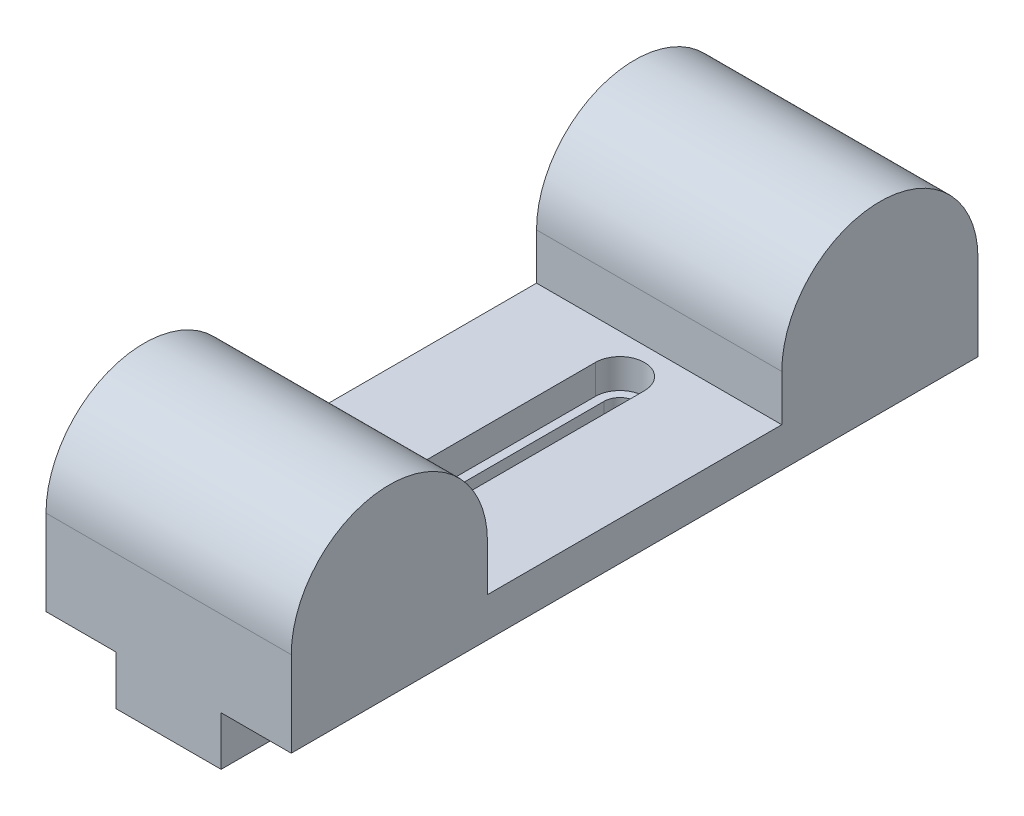
ISO-10303-21;
HEADER;
FILE_DESCRIPTION(('STEP AP214'),'2;1');
FILE_NAME('part.step','',(''),(''),'','','');
FILE_SCHEMA(('AUTOMOTIVE_DESIGN { 1 0 10303 214 1 1 1 1 }'));
ENDSEC;
DATA;
#1=APPLICATION_CONTEXT('core data for automotive mechanical design processes');
#2=APPLICATION_PROTOCOL_DEFINITION('international standard','automotive_design',2000,#1);
#3=PRODUCT_CONTEXT('',#1,'mechanical');
#4=PRODUCT('Part','Part','',(#3));
#5=PRODUCT_RELATED_PRODUCT_CATEGORY('part','',(#4));
#6=PRODUCT_DEFINITION_FORMATION('','',#4);
#7=PRODUCT_DEFINITION_CONTEXT('part definition',#1,'design');
#8=PRODUCT_DEFINITION('design','',#6,#7);
#9=PRODUCT_DEFINITION_SHAPE('','',#8);
#10=(LENGTH_UNIT() NAMED_UNIT(*) SI_UNIT(.MILLI.,.METRE.));
#11=(NAMED_UNIT(*) PLANE_ANGLE_UNIT() SI_UNIT($,.RADIAN.));
#12=(NAMED_UNIT(*) SI_UNIT($,.STERADIAN.) SOLID_ANGLE_UNIT());
#13=UNCERTAINTY_MEASURE_WITH_UNIT(LENGTH_MEASURE(1.E-05),#10,'distance_accuracy_value','');
#14=(GEOMETRIC_REPRESENTATION_CONTEXT(3) GLOBAL_UNCERTAINTY_ASSIGNED_CONTEXT((#13)) GLOBAL_UNIT_ASSIGNED_CONTEXT((#10,
#11,#12)) REPRESENTATION_CONTEXT('',''));
#15=CARTESIAN_POINT('',(0.,0.,0.));
#16=DIRECTION('',(0.,0.,1.));
#17=DIRECTION('',(1.,0.,0.));
#18=AXIS2_PLACEMENT_3D('',#15,#16,#17);
#19=CARTESIAN_POINT('',(0.,-5.,-46.));
#20=DIRECTION('',(0.,1.,0.));
#21=DIRECTION('',(0.,0.,1.));
#22=AXIS2_PLACEMENT_3D('',#19,#20,#21);
#23=CYLINDRICAL_SURFACE('',#22,1.625);
#24=CARTESIAN_POINT('',(0.,1.,-46.));
#25=DIRECTION('',(0.,1.,0.));
#26=DIRECTION('',(0.,0.,1.));
#27=AXIS2_PLACEMENT_3D('',#24,#25,#26);
#28=CIRCLE('',#27,1.625);
#29=CARTESIAN_POINT('',(1.625,1.,-46.));
#30=VERTEX_POINT('',#29);
#31=CARTESIAN_POINT('',(-1.625,1.,-46.));
#32=VERTEX_POINT('',#31);
#33=EDGE_CURVE('E217',#30,#32,#28,.T.);
#34=ORIENTED_EDGE('',*,*,#33,.T.);
#35=DIRECTION('',(0.,1.,0.));
#36=VECTOR('',#35,1.);
#37=CARTESIAN_POINT('',(-1.625,-5.,-46.));
#38=LINE('',#37,#36);
#39=CARTESIAN_POINT('',(-1.62500000000001,-5.,-46.));
#40=VERTEX_POINT('',#39);
#41=EDGE_CURVE('E244',#40,#32,#38,.T.);
#42=ORIENTED_EDGE('',*,*,#41,.F.);
#43=CARTESIAN_POINT('',(0.,-5.,-46.));
#44=DIRECTION('',(0.,1.,0.));
#45=DIRECTION('',(0.,0.,1.));
#46=AXIS2_PLACEMENT_3D('',#43,#44,#45);
#47=CIRCLE('',#46,1.625);
#48=CARTESIAN_POINT('',(-1.4079128759956,-5.,-46.8114224137931));
#49=VERTEX_POINT('',#48);
#50=EDGE_CURVE('E12',#49,#40,#47,.T.);
#51=ORIENTED_EDGE('',*,*,#50,.F.);
#52=DIRECTION('',(0.,1.,0.));
#53=VECTOR('',#52,1.);
#54=CARTESIAN_POINT('',(-1.4079128759956,6.85,-46.8114224137931));
#55=LINE('',#54,#53);
#56=CARTESIAN_POINT('',(-1.4079128759956,0.,-46.8114224137931));
#57=VERTEX_POINT('',#56);
#58=EDGE_CURVE('E259',#57,#49,#55,.F.);
#59=ORIENTED_EDGE('',*,*,#58,.F.);
#60=CARTESIAN_POINT('',(0.,0.,-46.));
#61=DIRECTION('',(0.,1.,0.));
#62=DIRECTION('',(0.,0.,1.));
#63=AXIS2_PLACEMENT_3D('',#60,#61,#62);
#64=CIRCLE('',#63,1.625);
#65=CARTESIAN_POINT('',(1.40791287599559,0.,-46.8114224137931));
#66=VERTEX_POINT('',#65);
#67=EDGE_CURVE('E242',#66,#57,#64,.T.);
#68=ORIENTED_EDGE('',*,*,#67,.F.);
#69=DIRECTION('',(0.,1.,0.));
#70=VECTOR('',#69,1.);
#71=CARTESIAN_POINT('',(1.40791287599558,6.85,-46.8114224137931));
#72=LINE('',#71,#70);
#73=CARTESIAN_POINT('',(1.40791287599558,-5.,-46.8114224137931));
#74=VERTEX_POINT('',#73);
#75=EDGE_CURVE('E237',#74,#66,#72,.T.);
#76=ORIENTED_EDGE('',*,*,#75,.F.);
#77=CARTESIAN_POINT('',(0.,-5.,-46.));
#78=DIRECTION('',(0.,1.,0.));
#79=DIRECTION('',(0.,0.,1.));
#80=AXIS2_PLACEMENT_3D('',#77,#78,#79);
#81=CIRCLE('',#80,1.625);
#82=CARTESIAN_POINT('',(1.625,-5.,-46.));
#83=VERTEX_POINT('',#82);
#84=EDGE_CURVE('E431',#83,#74,#81,.T.);
#85=ORIENTED_EDGE('',*,*,#84,.F.);
#86=DIRECTION('',(0.,1.,0.));
#87=VECTOR('',#86,1.);
#88=CARTESIAN_POINT('',(1.625,-5.,-46.));
#89=LINE('',#88,#87);
#90=EDGE_CURVE('E253',#83,#30,#89,.T.);
#91=ORIENTED_EDGE('',*,*,#90,.T.);
#92=EDGE_LOOP('',(#34,#42,#51,#59,#68,#76,#85,#91));
#93=FACE_BOUND('',#92,.T.);
#94=ADVANCED_FACE('F65',(#93),#23,.F.);
#95=CARTESIAN_POINT('',(1.62500000000001,-5.,0.));
#96=DIRECTION('',(-1.,0.,0.));
#97=DIRECTION('',(0.,0.,1.));
#98=AXIS2_PLACEMENT_3D('',#95,#96,#97);
#99=PLANE('',#98);
#100=DIRECTION('',(0.,1.,0.));
#101=VECTOR('',#100,1.);
#102=CARTESIAN_POINT('',(1.62500000000001,-5.,-25.));
#103=LINE('',#102,#101);
#104=CARTESIAN_POINT('',(1.62500000000001,-5.,-25.));
#105=VERTEX_POINT('',#104);
#106=CARTESIAN_POINT('',(1.62500000000001,1.,-25.));
#107=VERTEX_POINT('',#106);
#108=EDGE_CURVE('E228',#105,#107,#103,.T.);
#109=ORIENTED_EDGE('',*,*,#108,.T.);
#110=DIRECTION('',(0.,0.,-1.));
#111=VECTOR('',#110,1.);
#112=CARTESIAN_POINT('',(1.62500000000001,1.,0.));
#113=LINE('',#112,#111);
#114=EDGE_CURVE('E213',#107,#30,#113,.T.);
#115=ORIENTED_EDGE('',*,*,#114,.T.);
#116=ORIENTED_EDGE('',*,*,#90,.F.);
#117=DIRECTION('',(0.,0.,1.));
#118=VECTOR('',#117,1.);
#119=CARTESIAN_POINT('',(1.62500000000001,-5.,0.));
#120=LINE('',#119,#118);
#121=EDGE_CURVE('E235',#83,#105,#120,.T.);
#122=ORIENTED_EDGE('',*,*,#121,.T.);
#123=EDGE_LOOP('',(#109,#115,#116,#122));
#124=FACE_BOUND('',#123,.T.);
#125=ADVANCED_FACE('F233',(#124),#99,.T.);
#126=CARTESIAN_POINT('',(0.,-5.,-25.));
#127=DIRECTION('',(0.,1.,0.));
#128=DIRECTION('',(0.,0.,1.));
#129=AXIS2_PLACEMENT_3D('',#126,#127,#128);
#130=CYLINDRICAL_SURFACE('',#129,1.62500000000001);
#131=CARTESIAN_POINT('',(0.,1.,-25.));
#132=DIRECTION('',(0.,1.,0.));
#133=DIRECTION('',(0.,0.,1.));
#134=AXIS2_PLACEMENT_3D('',#131,#132,#133);
#135=CIRCLE('',#134,1.62500000000001);
#136=CARTESIAN_POINT('',(-1.625,1.,-25.));
#137=VERTEX_POINT('',#136);
#138=EDGE_CURVE('E89',#137,#107,#135,.T.);
#139=ORIENTED_EDGE('',*,*,#138,.T.);
#140=ORIENTED_EDGE('',*,*,#108,.F.);
#141=CARTESIAN_POINT('',(0.,-5.,-25.));
#142=DIRECTION('',(0.,1.,0.));
#143=DIRECTION('',(0.,0.,1.));
#144=AXIS2_PLACEMENT_3D('',#141,#142,#143);
#145=CIRCLE('',#144,1.62500000000001);
#146=CARTESIAN_POINT('',(-1.625,-5.,-25.));
#147=VERTEX_POINT('',#146);
#148=EDGE_CURVE('E247',#147,#105,#145,.T.);
#149=ORIENTED_EDGE('',*,*,#148,.F.);
#150=DIRECTION('',(0.,1.,0.));
#151=VECTOR('',#150,1.);
#152=CARTESIAN_POINT('',(-1.625,-5.,-25.));
#153=LINE('',#152,#151);
#154=EDGE_CURVE('E230',#147,#137,#153,.T.);
#155=ORIENTED_EDGE('',*,*,#154,.T.);
#156=EDGE_LOOP('',(#139,#140,#149,#155));
#157=FACE_BOUND('',#156,.T.);
#158=ADVANCED_FACE('F226',(#157),#130,.F.);
#159=CARTESIAN_POINT('',(-1.62500000000009,-5.,0.));
#160=DIRECTION('',(-1.,0.,0.));
#161=DIRECTION('',(0.,0.,1.));
#162=AXIS2_PLACEMENT_3D('',#159,#160,#161);
#163=PLANE('',#162);
#164=DIRECTION('',(0.,0.,-1.));
#165=VECTOR('',#164,1.);
#166=CARTESIAN_POINT('',(-1.625,1.,0.));
#167=LINE('',#166,#165);
#168=EDGE_CURVE('E469',#137,#32,#167,.T.);
#169=ORIENTED_EDGE('',*,*,#168,.F.);
#170=ORIENTED_EDGE('',*,*,#154,.F.);
#171=DIRECTION('',(0.,0.,1.));
#172=VECTOR('',#171,1.);
#173=CARTESIAN_POINT('',(-1.62500000000009,-5.,0.));
#174=LINE('',#173,#172);
#175=EDGE_CURVE('E434',#40,#147,#174,.T.);
#176=ORIENTED_EDGE('',*,*,#175,.F.);
#177=ORIENTED_EDGE('',*,*,#41,.T.);
#178=EDGE_LOOP('',(#169,#170,#176,#177));
#179=FACE_BOUND('',#178,.T.);
#180=ADVANCED_FACE('F488',(#179),#163,.F.);
#181=CARTESIAN_POINT('',(12.5,4.,0.));
#182=DIRECTION('',(0.,1.,0.));
#183=DIRECTION('',(0.,0.,1.));
#184=AXIS2_PLACEMENT_3D('',#181,#182,#183);
#185=PLANE('',#184);
#186=CARTESIAN_POINT('',(0.,4.,-25.));
#187=DIRECTION('',(0.,1.,0.));
#188=DIRECTION('',(0.,0.,1.));
#189=AXIS2_PLACEMENT_3D('',#186,#187,#188);
#190=CIRCLE('',#189,2.50000000000001);
#191=CARTESIAN_POINT('',(-2.5,4.,-25.));
#192=VERTEX_POINT('',#191);
#193=CARTESIAN_POINT('',(2.50000000000001,4.,-25.));
#194=VERTEX_POINT('',#193);
#195=EDGE_CURVE('E81',#192,#194,#190,.T.);
#196=ORIENTED_EDGE('',*,*,#195,.F.);
#197=DIRECTION('',(0.,0.,-1.));
#198=VECTOR('',#197,1.);
#199=CARTESIAN_POINT('',(-2.5,4.,0.));
#200=LINE('',#199,#198);
#201=CARTESIAN_POINT('',(-2.50000000000001,4.,-46.));
#202=VERTEX_POINT('',#201);
#203=EDGE_CURVE('E454',#192,#202,#200,.T.);
#204=ORIENTED_EDGE('',*,*,#203,.T.);
#205=CARTESIAN_POINT('',(0.,4.,-46.));
#206=DIRECTION('',(0.,1.,0.));
#207=DIRECTION('',(0.,0.,1.));
#208=AXIS2_PLACEMENT_3D('',#205,#206,#207);
#209=CIRCLE('',#208,2.5);
#210=CARTESIAN_POINT('',(2.49999999999999,4.,-46.));
#211=VERTEX_POINT('',#210);
#212=EDGE_CURVE('E459',#211,#202,#209,.T.);
#213=ORIENTED_EDGE('',*,*,#212,.F.);
#214=DIRECTION('',(0.,0.,-1.));
#215=VECTOR('',#214,1.);
#216=CARTESIAN_POINT('',(2.50000000000001,4.,0.));
#217=LINE('',#216,#215);
#218=EDGE_CURVE('E463',#194,#211,#217,.T.);
#219=ORIENTED_EDGE('',*,*,#218,.F.);
#220=EDGE_LOOP('',(#196,#204,#213,#219));
#221=FACE_BOUND('',#220,.T.);
#222=DIRECTION('',(0.,0.,-1.));
#223=VECTOR('',#222,1.);
#224=CARTESIAN_POINT('',(-12.5,4.,0.));
#225=LINE('',#224,#223);
#226=CARTESIAN_POINT('',(-12.5,4.,-20.));
#227=VERTEX_POINT('',#226);
#228=CARTESIAN_POINT('',(-12.5,4.,-50.));
#229=VERTEX_POINT('',#228);
#230=EDGE_CURVE('E359',#227,#229,#225,.T.);
#231=ORIENTED_EDGE('',*,*,#230,.F.);
#232=DIRECTION('',(-1.,0.,0.));
#233=VECTOR('',#232,1.);
#234=CARTESIAN_POINT('',(12.5,4.,-20.));
#235=LINE('',#234,#233);
#236=CARTESIAN_POINT('',(12.5,4.,-20.));
#237=VERTEX_POINT('',#236);
#238=EDGE_CURVE('E368',#237,#227,#235,.T.);
#239=ORIENTED_EDGE('',*,*,#238,.F.);
#240=DIRECTION('',(0.,0.,-1.));
#241=VECTOR('',#240,1.);
#242=CARTESIAN_POINT('',(12.5,4.,0.));
#243=LINE('',#242,#241);
#244=CARTESIAN_POINT('',(12.5,4.,-50.));
#245=VERTEX_POINT('',#244);
#246=EDGE_CURVE('E328',#237,#245,#243,.T.);
#247=ORIENTED_EDGE('',*,*,#246,.T.);
#248=DIRECTION('',(-1.,0.,0.));
#249=VECTOR('',#248,1.);
#250=CARTESIAN_POINT('',(12.5,4.,-50.));
#251=LINE('',#250,#249);
#252=EDGE_CURVE('E371',#245,#229,#251,.T.);
#253=ORIENTED_EDGE('',*,*,#252,.T.);
#254=EDGE_LOOP('',(#231,#239,#247,#253));
#255=FACE_BOUND('',#254,.T.);
#256=ADVANCED_FACE('F516',(#221,#255),#185,.T.);
#257=CARTESIAN_POINT('',(0.,-5.,-41.65));
#258=DIRECTION('',(0.,1.,0.));
#259=DIRECTION('',(0.,0.,1.));
#260=AXIS2_PLACEMENT_3D('',#257,#258,#259);
#261=CYLINDRICAL_SURFACE('',#260,5.35000000000001);
#262=CARTESIAN_POINT('',(0.,0.,-41.65));
#263=DIRECTION('',(0.,1.,0.));
#264=DIRECTION('',(0.,0.,1.));
#265=AXIS2_PLACEMENT_3D('',#262,#263,#264);
#266=CIRCLE('',#265,5.35000000000001);
#267=CARTESIAN_POINT('',(-5.35000000000002,0.,-41.65));
#268=VERTEX_POINT('',#267);
#269=EDGE_CURVE('E281',#268,#57,#266,.F.);
#270=ORIENTED_EDGE('',*,*,#269,.T.);
#271=ORIENTED_EDGE('',*,*,#58,.T.);
#272=CARTESIAN_POINT('',(0.,-5.,-41.65));
#273=DIRECTION('',(0.,1.,0.));
#274=DIRECTION('',(0.,0.,1.));
#275=AXIS2_PLACEMENT_3D('',#272,#273,#274);
#276=CIRCLE('',#275,5.35000000000001);
#277=CARTESIAN_POINT('',(-5.35000000000002,-5.,-41.65));
#278=VERTEX_POINT('',#277);
#279=EDGE_CURVE('E264',#278,#49,#276,.F.);
#280=ORIENTED_EDGE('',*,*,#279,.F.);
#281=DIRECTION('',(0.,1.,0.));
#282=VECTOR('',#281,1.);
#283=CARTESIAN_POINT('',(-5.35000000000002,-5.,-41.65));
#284=LINE('',#283,#282);
#285=EDGE_CURVE('E280',#278,#268,#284,.T.);
#286=ORIENTED_EDGE('',*,*,#285,.T.);
#287=EDGE_LOOP('',(#270,#271,#280,#286));
#288=FACE_BOUND('',#287,.T.);
#289=ADVANCED_FACE('F491',(#288),#261,.T.);
#290=CARTESIAN_POINT('',(12.5,0.,0.));
#291=DIRECTION('',(0.,1.,0.));
#292=DIRECTION('',(0.,0.,1.));
#293=AXIS2_PLACEMENT_3D('',#290,#291,#292);
#294=PLANE('',#293);
#295=CARTESIAN_POINT('',(5.35,0.,-41.65));
#296=VERTEX_POINT('',#295);
#297=EDGE_CURVE('E263',#66,#296,#266,.F.);
#298=ORIENTED_EDGE('',*,*,#297,.F.);
#299=ORIENTED_EDGE('',*,*,#67,.T.);
#300=ORIENTED_EDGE('',*,*,#269,.F.);
#301=DIRECTION('',(0.,0.,-1.));
#302=VECTOR('',#301,1.);
#303=CARTESIAN_POINT('',(-5.35,0.,0.));
#304=LINE('',#303,#302);
#305=CARTESIAN_POINT('',(-5.35,0.,0.));
#306=VERTEX_POINT('',#305);
#307=EDGE_CURVE('E285',#306,#268,#304,.T.);
#308=ORIENTED_EDGE('',*,*,#307,.F.);
#309=DIRECTION('',(-1.,0.,0.));
#310=VECTOR('',#309,1.);
#311=CARTESIAN_POINT('',(12.5,0.,0.));
#312=LINE('',#311,#310);
#313=CARTESIAN_POINT('',(-12.5,0.,0.));
#314=VERTEX_POINT('',#313);
#315=EDGE_CURVE('E384',#306,#314,#312,.T.);
#316=ORIENTED_EDGE('',*,*,#315,.T.);
#317=DIRECTION('',(0.,0.,-1.));
#318=VECTOR('',#317,1.);
#319=CARTESIAN_POINT('',(-12.5,0.,0.));
#320=LINE('',#319,#318);
#321=CARTESIAN_POINT('',(-12.5,0.,-70.));
#322=VERTEX_POINT('',#321);
#323=EDGE_CURVE('E344',#314,#322,#320,.T.);
#324=ORIENTED_EDGE('',*,*,#323,.T.);
#325=DIRECTION('',(-1.,0.,0.));
#326=VECTOR('',#325,1.);
#327=CARTESIAN_POINT('',(12.5,0.,-70.));
#328=LINE('',#327,#326);
#329=CARTESIAN_POINT('',(12.5,0.,-70.));
#330=VERTEX_POINT('',#329);
#331=EDGE_CURVE('E380',#330,#322,#328,.T.);
#332=ORIENTED_EDGE('',*,*,#331,.F.);
#333=DIRECTION('',(0.,0.,-1.));
#334=VECTOR('',#333,1.);
#335=CARTESIAN_POINT('',(12.5,0.,0.));
#336=LINE('',#335,#334);
#337=CARTESIAN_POINT('',(12.5,0.,0.));
#338=VERTEX_POINT('',#337);
#339=EDGE_CURVE('E315',#338,#330,#336,.T.);
#340=ORIENTED_EDGE('',*,*,#339,.F.);
#341=CARTESIAN_POINT('',(5.35,0.,0.));
#342=VERTEX_POINT('',#341);
#343=EDGE_CURVE('E385',#338,#342,#312,.T.);
#344=ORIENTED_EDGE('',*,*,#343,.T.);
#345=DIRECTION('',(0.,0.,-1.));
#346=VECTOR('',#345,1.);
#347=CARTESIAN_POINT('',(5.35,0.,0.));
#348=LINE('',#347,#346);
#349=EDGE_CURVE('E288',#342,#296,#348,.T.);
#350=ORIENTED_EDGE('',*,*,#349,.T.);
#351=EDGE_LOOP('',(#298,#299,#300,#308,#316,#324,#332,#340,#344,#350));
#352=FACE_BOUND('',#351,.T.);
#353=ADVANCED_FACE('F405',(#352),#294,.F.);
#354=CARTESIAN_POINT('',(12.5,8.7,-10.));
#355=DIRECTION('',(-1.,0.,0.));
#356=DIRECTION('',(0.,0.,1.));
#357=AXIS2_PLACEMENT_3D('',#354,#355,#356);
#358=CYLINDRICAL_SURFACE('',#357,10.);
#359=CARTESIAN_POINT('',(-12.5,8.7,-10.));
#360=DIRECTION('',(1.,0.,0.));
#361=DIRECTION('',(0.,0.,-1.));
#362=AXIS2_PLACEMENT_3D('',#359,#360,#361);
#363=CIRCLE('',#362,10.);
#364=CARTESIAN_POINT('',(-12.5,8.7,0.));
#365=VERTEX_POINT('',#364);
#366=CARTESIAN_POINT('',(-12.5,8.7,-20.));
#367=VERTEX_POINT('',#366);
#368=EDGE_CURVE('E296',#365,#367,#363,.F.);
#369=ORIENTED_EDGE('',*,*,#368,.F.);
#370=DIRECTION('',(-1.,0.,0.));
#371=VECTOR('',#370,1.);
#372=CARTESIAN_POINT('',(12.5,8.7,0.));
#373=LINE('',#372,#371);
#374=CARTESIAN_POINT('',(12.5,8.7,0.));
#375=VERTEX_POINT('',#374);
#376=EDGE_CURVE('E74',#375,#365,#373,.T.);
#377=ORIENTED_EDGE('',*,*,#376,.F.);
#378=CARTESIAN_POINT('',(12.5,8.7,-10.));
#379=DIRECTION('',(1.,0.,0.));
#380=DIRECTION('',(0.,0.,-1.));
#381=AXIS2_PLACEMENT_3D('',#378,#379,#380);
#382=CIRCLE('',#381,10.);
#383=CARTESIAN_POINT('',(12.5,8.7,-20.));
#384=VERTEX_POINT('',#383);
#385=EDGE_CURVE('E306',#375,#384,#382,.F.);
#386=ORIENTED_EDGE('',*,*,#385,.T.);
#387=DIRECTION('',(-1.,0.,0.));
#388=VECTOR('',#387,1.);
#389=CARTESIAN_POINT('',(12.5,8.7,-20.));
#390=LINE('',#389,#388);
#391=EDGE_CURVE('E336',#384,#367,#390,.T.);
#392=ORIENTED_EDGE('',*,*,#391,.T.);
#393=EDGE_LOOP('',(#369,#377,#386,#392));
#394=FACE_BOUND('',#393,.T.);
#395=ADVANCED_FACE('F67',(#394),#358,.T.);
#396=CARTESIAN_POINT('',(12.5,0.,0.));
#397=DIRECTION('',(0.,0.,1.));
#398=DIRECTION('',(1.,0.,0.));
#399=AXIS2_PLACEMENT_3D('',#396,#397,#398);
#400=PLANE('',#399);
#401=DIRECTION('',(0.,1.,0.));
#402=VECTOR('',#401,1.);
#403=CARTESIAN_POINT('',(-12.5,0.,0.));
#404=LINE('',#403,#402);
#405=EDGE_CURVE('E340',#314,#365,#404,.T.);
#406=ORIENTED_EDGE('',*,*,#405,.F.);
#407=ORIENTED_EDGE('',*,*,#315,.F.);
#408=DIRECTION('',(0.,1.,0.));
#409=VECTOR('',#408,1.);
#410=CARTESIAN_POINT('',(-5.35,-5.,0.));
#411=LINE('',#410,#409);
#412=CARTESIAN_POINT('',(-5.35,-5.,0.));
#413=VERTEX_POINT('',#412);
#414=EDGE_CURVE('E300',#413,#306,#411,.T.);
#415=ORIENTED_EDGE('',*,*,#414,.F.);
#416=DIRECTION('',(1.,0.,0.));
#417=VECTOR('',#416,1.);
#418=CARTESIAN_POINT('',(0.,-5.,0.));
#419=LINE('',#418,#417);
#420=CARTESIAN_POINT('',(5.35,-5.,0.));
#421=VERTEX_POINT('',#420);
#422=EDGE_CURVE('E272',#413,#421,#419,.T.);
#423=ORIENTED_EDGE('',*,*,#422,.T.);
#424=DIRECTION('',(0.,1.,0.));
#425=VECTOR('',#424,1.);
#426=CARTESIAN_POINT('',(5.35,-5.,0.));
#427=LINE('',#426,#425);
#428=EDGE_CURVE('E297',#421,#342,#427,.T.);
#429=ORIENTED_EDGE('',*,*,#428,.T.);
#430=ORIENTED_EDGE('',*,*,#343,.F.);
#431=DIRECTION('',(0.,1.,0.));
#432=VECTOR('',#431,1.);
#433=CARTESIAN_POINT('',(12.5,0.,0.));
#434=LINE('',#433,#432);
#435=EDGE_CURVE('E310',#338,#375,#434,.T.);
#436=ORIENTED_EDGE('',*,*,#435,.T.);
#437=ORIENTED_EDGE('',*,*,#376,.T.);
#438=EDGE_LOOP('',(#406,#407,#415,#423,#429,#430,#436,#437));
#439=FACE_BOUND('',#438,.T.);
#440=ADVANCED_FACE('F392',(#439),#400,.T.);
#441=CARTESIAN_POINT('',(12.5,0.,-70.));
#442=DIRECTION('',(0.,0.,1.));
#443=DIRECTION('',(1.,0.,0.));
#444=AXIS2_PLACEMENT_3D('',#441,#442,#443);
#445=PLANE('',#444);
#446=DIRECTION('',(0.,1.,0.));
#447=VECTOR('',#446,1.);
#448=CARTESIAN_POINT('',(-12.5,0.,-70.));
#449=LINE('',#448,#447);
#450=CARTESIAN_POINT('',(-12.5,8.7,-70.));
#451=VERTEX_POINT('',#450);
#452=EDGE_CURVE('E347',#322,#451,#449,.T.);
#453=ORIENTED_EDGE('',*,*,#452,.T.);
#454=DIRECTION('',(-1.,0.,0.));
#455=VECTOR('',#454,1.);
#456=CARTESIAN_POINT('',(12.5,8.7,-70.));
#457=LINE('',#456,#455);
#458=CARTESIAN_POINT('',(12.5,8.7,-70.));
#459=VERTEX_POINT('',#458);
#460=EDGE_CURVE('E377',#459,#451,#457,.T.);
#461=ORIENTED_EDGE('',*,*,#460,.F.);
#462=DIRECTION('',(0.,1.,0.));
#463=VECTOR('',#462,1.);
#464=CARTESIAN_POINT('',(12.5,0.,-70.));
#465=LINE('',#464,#463);
#466=EDGE_CURVE('E318',#330,#459,#465,.T.);
#467=ORIENTED_EDGE('',*,*,#466,.F.);
#468=ORIENTED_EDGE('',*,*,#331,.T.);
#469=EDGE_LOOP('',(#453,#461,#467,#468));
#470=FACE_BOUND('',#469,.T.);
#471=ADVANCED_FACE('F410',(#470),#445,.F.);
#472=CARTESIAN_POINT('',(12.5,8.7,-60.));
#473=DIRECTION('',(-1.,0.,0.));
#474=DIRECTION('',(0.,0.,1.));
#475=AXIS2_PLACEMENT_3D('',#472,#473,#474);
#476=CYLINDRICAL_SURFACE('',#475,10.);
#477=CARTESIAN_POINT('',(-12.5,8.7,-60.));
#478=DIRECTION('',(1.,0.,0.));
#479=DIRECTION('',(0.,0.,-1.));
#480=AXIS2_PLACEMENT_3D('',#477,#478,#479);
#481=CIRCLE('',#480,10.);
#482=CARTESIAN_POINT('',(-12.5,8.7,-50.));
#483=VERTEX_POINT('',#482);
#484=EDGE_CURVE('E351',#483,#451,#481,.F.);
#485=ORIENTED_EDGE('',*,*,#484,.F.);
#486=DIRECTION('',(-1.,0.,0.));
#487=VECTOR('',#486,1.);
#488=CARTESIAN_POINT('',(12.5,8.7,-50.));
#489=LINE('',#488,#487);
#490=CARTESIAN_POINT('',(12.5,8.7,-50.));
#491=VERTEX_POINT('',#490);
#492=EDGE_CURVE('E374',#491,#483,#489,.T.);
#493=ORIENTED_EDGE('',*,*,#492,.F.);
#494=CARTESIAN_POINT('',(12.5,8.7,-60.));
#495=DIRECTION('',(1.,0.,0.));
#496=DIRECTION('',(0.,0.,-1.));
#497=AXIS2_PLACEMENT_3D('',#494,#495,#496);
#498=CIRCLE('',#497,10.);
#499=EDGE_CURVE('E321',#491,#459,#498,.F.);
#500=ORIENTED_EDGE('',*,*,#499,.T.);
#501=ORIENTED_EDGE('',*,*,#460,.T.);
#502=EDGE_LOOP('',(#485,#493,#500,#501));
#503=FACE_BOUND('',#502,.T.);
#504=ADVANCED_FACE('F627',(#503),#476,.T.);
#505=CARTESIAN_POINT('',(12.5,0.,-50.));
#506=DIRECTION('',(0.,0.,-1.));
#507=DIRECTION('',(-1.,0.,0.));
#508=AXIS2_PLACEMENT_3D('',#505,#506,#507);
#509=PLANE('',#508);
#510=DIRECTION('',(0.,-1.,0.));
#511=VECTOR('',#510,1.);
#512=CARTESIAN_POINT('',(-12.5,0.,-50.));
#513=LINE('',#512,#511);
#514=EDGE_CURVE('E355',#483,#229,#513,.T.);
#515=ORIENTED_EDGE('',*,*,#514,.T.);
#516=ORIENTED_EDGE('',*,*,#252,.F.);
#517=DIRECTION('',(0.,-1.,0.));
#518=VECTOR('',#517,1.);
#519=CARTESIAN_POINT('',(12.5,0.,-50.));
#520=LINE('',#519,#518);
#521=EDGE_CURVE('E325',#491,#245,#520,.T.);
#522=ORIENTED_EDGE('',*,*,#521,.F.);
#523=ORIENTED_EDGE('',*,*,#492,.T.);
#524=EDGE_LOOP('',(#515,#516,#522,#523));
#525=FACE_BOUND('',#524,.T.);
#526=ADVANCED_FACE('F634',(#525),#509,.F.);
#527=CARTESIAN_POINT('',(12.5,0.,-20.));
#528=DIRECTION('',(0.,0.,-1.));
#529=DIRECTION('',(0.,1.,0.));
#530=AXIS2_PLACEMENT_3D('',#527,#528,#529);
#531=PLANE('',#530);
#532=DIRECTION('',(0.,-1.,0.));
#533=VECTOR('',#532,1.);
#534=CARTESIAN_POINT('',(-12.5,0.,-20.));
#535=LINE('',#534,#533);
#536=EDGE_CURVE('E311',#367,#227,#535,.T.);
#537=ORIENTED_EDGE('',*,*,#536,.F.);
#538=ORIENTED_EDGE('',*,*,#391,.F.);
#539=DIRECTION('',(0.,-1.,0.));
#540=VECTOR('',#539,1.);
#541=CARTESIAN_POINT('',(12.5,0.,-20.));
#542=LINE('',#541,#540);
#543=EDGE_CURVE('E332',#384,#237,#542,.T.);
#544=ORIENTED_EDGE('',*,*,#543,.T.);
#545=ORIENTED_EDGE('',*,*,#238,.T.);
#546=EDGE_LOOP('',(#537,#538,#544,#545));
#547=FACE_BOUND('',#546,.T.);
#548=ADVANCED_FACE('F642',(#547),#531,.T.);
#549=CARTESIAN_POINT('',(12.5,0.,0.));
#550=DIRECTION('',(1.,0.,0.));
#551=DIRECTION('',(0.,0.,-1.));
#552=AXIS2_PLACEMENT_3D('',#549,#550,#551);
#553=PLANE('',#552);
#554=ORIENTED_EDGE('',*,*,#385,.F.);
#555=ORIENTED_EDGE('',*,*,#435,.F.);
#556=ORIENTED_EDGE('',*,*,#339,.T.);
#557=ORIENTED_EDGE('',*,*,#466,.T.);
#558=ORIENTED_EDGE('',*,*,#499,.F.);
#559=ORIENTED_EDGE('',*,*,#521,.T.);
#560=ORIENTED_EDGE('',*,*,#246,.F.);
#561=ORIENTED_EDGE('',*,*,#543,.F.);
#562=EDGE_LOOP('',(#554,#555,#556,#557,#558,#559,#560,#561));
#563=FACE_BOUND('',#562,.T.);
#564=ADVANCED_FACE('F414',(#563),#553,.T.);
#565=CARTESIAN_POINT('',(-12.5,0.,0.));
#566=DIRECTION('',(1.,0.,0.));
#567=DIRECTION('',(0.,0.,-1.));
#568=AXIS2_PLACEMENT_3D('',#565,#566,#567);
#569=PLANE('',#568);
#570=ORIENTED_EDGE('',*,*,#368,.T.);
#571=ORIENTED_EDGE('',*,*,#536,.T.);
#572=ORIENTED_EDGE('',*,*,#230,.T.);
#573=ORIENTED_EDGE('',*,*,#514,.F.);
#574=ORIENTED_EDGE('',*,*,#484,.T.);
#575=ORIENTED_EDGE('',*,*,#452,.F.);
#576=ORIENTED_EDGE('',*,*,#323,.F.);
#577=ORIENTED_EDGE('',*,*,#405,.T.);
#578=EDGE_LOOP('',(#570,#571,#572,#573,#574,#575,#576,#577));
#579=FACE_BOUND('',#578,.T.);
#580=ADVANCED_FACE('F400',(#579),#569,.F.);
#581=CARTESIAN_POINT('',(5.35,-5.,-41.65));
#582=VERTEX_POINT('',#581);
#583=EDGE_CURVE('E269',#74,#582,#276,.F.);
#584=ORIENTED_EDGE('',*,*,#583,.F.);
#585=ORIENTED_EDGE('',*,*,#75,.T.);
#586=ORIENTED_EDGE('',*,*,#297,.T.);
#587=DIRECTION('',(0.,1.,0.));
#588=VECTOR('',#587,1.);
#589=CARTESIAN_POINT('',(5.35,-5.,-41.65));
#590=LINE('',#589,#588);
#591=EDGE_CURVE('E292',#582,#296,#590,.T.);
#592=ORIENTED_EDGE('',*,*,#591,.F.);
#593=EDGE_LOOP('',(#584,#585,#586,#592));
#594=FACE_BOUND('',#593,.T.);
#595=ADVANCED_FACE('F423',(#594),#261,.T.);
#596=CARTESIAN_POINT('',(5.35,-5.,0.));
#597=DIRECTION('',(1.,0.,0.));
#598=DIRECTION('',(0.,0.,-1.));
#599=AXIS2_PLACEMENT_3D('',#596,#597,#598);
#600=PLANE('',#599);
#601=ORIENTED_EDGE('',*,*,#349,.F.);
#602=ORIENTED_EDGE('',*,*,#428,.F.);
#603=DIRECTION('',(0.,0.,-1.));
#604=VECTOR('',#603,1.);
#605=CARTESIAN_POINT('',(5.35,-5.,0.));
#606=LINE('',#605,#604);
#607=EDGE_CURVE('E276',#421,#582,#606,.T.);
#608=ORIENTED_EDGE('',*,*,#607,.T.);
#609=ORIENTED_EDGE('',*,*,#591,.T.);
#610=EDGE_LOOP('',(#601,#602,#608,#609));
#611=FACE_BOUND('',#610,.T.);
#612=ADVANCED_FACE('F419',(#611),#600,.T.);
#613=CARTESIAN_POINT('',(-5.35,-5.,0.));
#614=DIRECTION('',(1.,0.,0.));
#615=DIRECTION('',(0.,0.,-1.));
#616=AXIS2_PLACEMENT_3D('',#613,#614,#615);
#617=PLANE('',#616);
#618=ORIENTED_EDGE('',*,*,#307,.T.);
#619=ORIENTED_EDGE('',*,*,#285,.F.);
#620=DIRECTION('',(0.,0.,-1.));
#621=VECTOR('',#620,1.);
#622=CARTESIAN_POINT('',(-5.35,-5.,0.));
#623=LINE('',#622,#621);
#624=EDGE_CURVE('E268',#413,#278,#623,.T.);
#625=ORIENTED_EDGE('',*,*,#624,.F.);
#626=ORIENTED_EDGE('',*,*,#414,.T.);
#627=EDGE_LOOP('',(#618,#619,#625,#626));
#628=FACE_BOUND('',#627,.T.);
#629=ADVANCED_FACE('F496',(#628),#617,.F.);
#630=CARTESIAN_POINT('',(0.,-5.,0.));
#631=DIRECTION('',(0.,1.,0.));
#632=DIRECTION('',(0.,0.,1.));
#633=AXIS2_PLACEMENT_3D('',#630,#631,#632);
#634=PLANE('',#633);
#635=ORIENTED_EDGE('',*,*,#121,.F.);
#636=ORIENTED_EDGE('',*,*,#84,.T.);
#637=ORIENTED_EDGE('',*,*,#583,.T.);
#638=ORIENTED_EDGE('',*,*,#607,.F.);
#639=ORIENTED_EDGE('',*,*,#422,.F.);
#640=ORIENTED_EDGE('',*,*,#624,.T.);
#641=ORIENTED_EDGE('',*,*,#279,.T.);
#642=ORIENTED_EDGE('',*,*,#50,.T.);
#643=ORIENTED_EDGE('',*,*,#175,.T.);
#644=ORIENTED_EDGE('',*,*,#148,.T.);
#645=EDGE_LOOP('',(#635,#636,#637,#638,#639,#640,#641,#642,#643,#644));
#646=FACE_BOUND('',#645,.T.);
#647=ADVANCED_FACE('F429',(#646),#634,.F.);
#648=CARTESIAN_POINT('',(0.,1.,-25.));
#649=DIRECTION('',(0.,1.,0.));
#650=DIRECTION('',(0.,0.,1.));
#651=AXIS2_PLACEMENT_3D('',#648,#649,#650);
#652=CYLINDRICAL_SURFACE('',#651,2.50000000000001);
#653=ORIENTED_EDGE('',*,*,#195,.T.);
#654=DIRECTION('',(0.,1.,0.));
#655=VECTOR('',#654,1.);
#656=CARTESIAN_POINT('',(2.50000000000001,1.,-25.));
#657=LINE('',#656,#655);
#658=CARTESIAN_POINT('',(2.50000000000001,1.,-25.));
#659=VERTEX_POINT('',#658);
#660=EDGE_CURVE('E442',#659,#194,#657,.T.);
#661=ORIENTED_EDGE('',*,*,#660,.F.);
#662=CARTESIAN_POINT('',(0.,1.,-25.));
#663=DIRECTION('',(0.,1.,0.));
#664=DIRECTION('',(0.,0.,1.));
#665=AXIS2_PLACEMENT_3D('',#662,#663,#664);
#666=CIRCLE('',#665,2.50000000000001);
#667=CARTESIAN_POINT('',(-2.5,1.,-25.));
#668=VERTEX_POINT('',#667);
#669=EDGE_CURVE('E458',#668,#659,#666,.T.);
#670=ORIENTED_EDGE('',*,*,#669,.F.);
#671=DIRECTION('',(0.,1.,0.));
#672=VECTOR('',#671,1.);
#673=CARTESIAN_POINT('',(-2.5,1.,-25.));
#674=LINE('',#673,#672);
#675=EDGE_CURVE('E439',#668,#192,#674,.T.);
#676=ORIENTED_EDGE('',*,*,#675,.T.);
#677=EDGE_LOOP('',(#653,#661,#670,#676));
#678=FACE_BOUND('',#677,.T.);
#679=ADVANCED_FACE('F503',(#678),#652,.F.);
#680=CARTESIAN_POINT('',(-2.5,1.,0.));
#681=DIRECTION('',(1.,0.,0.));
#682=DIRECTION('',(0.,0.,-1.));
#683=AXIS2_PLACEMENT_3D('',#680,#681,#682);
#684=PLANE('',#683);
#685=ORIENTED_EDGE('',*,*,#203,.F.);
#686=ORIENTED_EDGE('',*,*,#675,.F.);
#687=DIRECTION('',(0.,0.,-1.));
#688=VECTOR('',#687,1.);
#689=CARTESIAN_POINT('',(-2.5,1.,0.));
#690=LINE('',#689,#688);
#691=CARTESIAN_POINT('',(-2.50000000000001,1.,-46.));
#692=VERTEX_POINT('',#691);
#693=EDGE_CURVE('E446',#668,#692,#690,.T.);
#694=ORIENTED_EDGE('',*,*,#693,.T.);
#695=DIRECTION('',(0.,1.,0.));
#696=VECTOR('',#695,1.);
#697=CARTESIAN_POINT('',(-2.50000000000001,1.,-46.));
#698=LINE('',#697,#696);
#699=EDGE_CURVE('E449',#692,#202,#698,.T.);
#700=ORIENTED_EDGE('',*,*,#699,.T.);
#701=EDGE_LOOP('',(#685,#686,#694,#700));
#702=FACE_BOUND('',#701,.T.);
#703=ADVANCED_FACE('F521',(#702),#684,.T.);
#704=CARTESIAN_POINT('',(0.,1.,-46.));
#705=DIRECTION('',(0.,1.,0.));
#706=DIRECTION('',(0.,0.,1.));
#707=AXIS2_PLACEMENT_3D('',#704,#705,#706);
#708=CYLINDRICAL_SURFACE('',#707,2.5);
#709=ORIENTED_EDGE('',*,*,#212,.T.);
#710=ORIENTED_EDGE('',*,*,#699,.F.);
#711=CARTESIAN_POINT('',(0.,1.,-46.));
#712=DIRECTION('',(0.,1.,0.));
#713=DIRECTION('',(0.,0.,1.));
#714=AXIS2_PLACEMENT_3D('',#711,#712,#713);
#715=CIRCLE('',#714,2.5);
#716=CARTESIAN_POINT('',(2.49999999999999,1.,-46.));
#717=VERTEX_POINT('',#716);
#718=EDGE_CURVE('E472',#717,#692,#715,.T.);
#719=ORIENTED_EDGE('',*,*,#718,.F.);
#720=DIRECTION('',(0.,1.,0.));
#721=VECTOR('',#720,1.);
#722=CARTESIAN_POINT('',(2.49999999999999,1.,-46.));
#723=LINE('',#722,#721);
#724=EDGE_CURVE('E445',#717,#211,#723,.T.);
#725=ORIENTED_EDGE('',*,*,#724,.T.);
#726=EDGE_LOOP('',(#709,#710,#719,#725));
#727=FACE_BOUND('',#726,.T.);
#728=ADVANCED_FACE('F525',(#727),#708,.F.);
#729=CARTESIAN_POINT('',(2.50000000000001,1.,0.));
#730=DIRECTION('',(1.,0.,0.));
#731=DIRECTION('',(0.,0.,-1.));
#732=AXIS2_PLACEMENT_3D('',#729,#730,#731);
#733=PLANE('',#732);
#734=ORIENTED_EDGE('',*,*,#218,.T.);
#735=ORIENTED_EDGE('',*,*,#724,.F.);
#736=DIRECTION('',(0.,0.,-1.));
#737=VECTOR('',#736,1.);
#738=CARTESIAN_POINT('',(2.50000000000001,1.,0.));
#739=LINE('',#738,#737);
#740=EDGE_CURVE('E476',#659,#717,#739,.T.);
#741=ORIENTED_EDGE('',*,*,#740,.F.);
#742=ORIENTED_EDGE('',*,*,#660,.T.);
#743=EDGE_LOOP('',(#734,#735,#741,#742));
#744=FACE_BOUND('',#743,.T.);
#745=ADVANCED_FACE('F522',(#744),#733,.F.);
#746=CARTESIAN_POINT('',(0.,1.,-25.));
#747=DIRECTION('',(0.,1.,0.));
#748=DIRECTION('',(0.,0.,1.));
#749=AXIS2_PLACEMENT_3D('',#746,#747,#748);
#750=PLANE('',#749);
#751=ORIENTED_EDGE('',*,*,#168,.T.);
#752=ORIENTED_EDGE('',*,*,#33,.F.);
#753=ORIENTED_EDGE('',*,*,#114,.F.);
#754=ORIENTED_EDGE('',*,*,#138,.F.);
#755=EDGE_LOOP('',(#751,#752,#753,#754));
#756=FACE_BOUND('',#755,.T.);
#757=ORIENTED_EDGE('',*,*,#669,.T.);
#758=ORIENTED_EDGE('',*,*,#740,.T.);
#759=ORIENTED_EDGE('',*,*,#718,.T.);
#760=ORIENTED_EDGE('',*,*,#693,.F.);
#761=EDGE_LOOP('',(#757,#758,#759,#760));
#762=FACE_BOUND('',#761,.T.);
#763=ADVANCED_FACE('F214',(#756,#762),#750,.T.);
#764=CLOSED_SHELL('',(#94,#125,#158,#180,#256,#289,#353,#395,#440,#471,#504,#526,#548,#564,#580,
#595,#612,#629,#647,#679,#703,#728,#745,#763));
#765=MANIFOLD_SOLID_BREP('B2',#764);
#766=ADVANCED_BREP_SHAPE_REPRESENTATION('',(#18,#765),#14);
#767=SHAPE_DEFINITION_REPRESENTATION(#9,#766);
ENDSEC;
END-ISO-10303-21;
